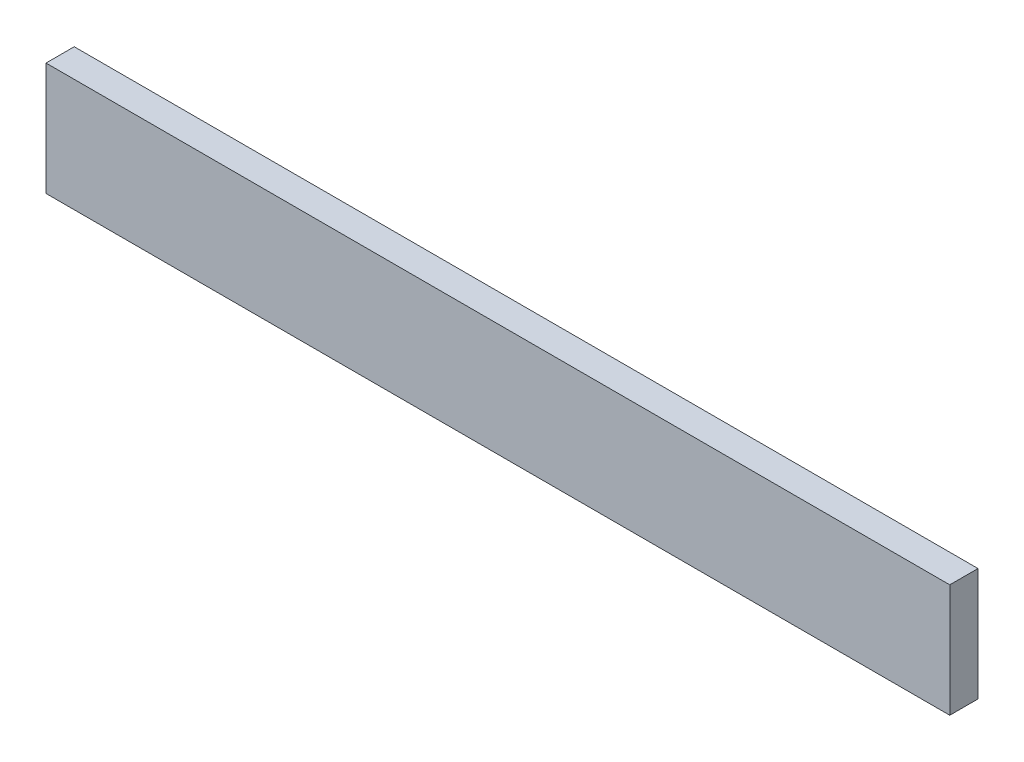
ISO-10303-21;
HEADER;
FILE_DESCRIPTION(('STEP AP214'),'2;1');
FILE_NAME('part.step','',(''),(''),'','','');
FILE_SCHEMA(('AUTOMOTIVE_DESIGN { 1 0 10303 214 1 1 1 1 }'));
ENDSEC;
DATA;
#1=APPLICATION_CONTEXT('core data for automotive mechanical design processes');
#2=APPLICATION_PROTOCOL_DEFINITION('international standard','automotive_design',2000,#1);
#3=PRODUCT_CONTEXT('',#1,'mechanical');
#4=PRODUCT('Part','Part','',(#3));
#5=PRODUCT_RELATED_PRODUCT_CATEGORY('part','',(#4));
#6=PRODUCT_DEFINITION_FORMATION('','',#4);
#7=PRODUCT_DEFINITION_CONTEXT('part definition',#1,'design');
#8=PRODUCT_DEFINITION('design','',#6,#7);
#9=PRODUCT_DEFINITION_SHAPE('','',#8);
#10=(LENGTH_UNIT() NAMED_UNIT(*) SI_UNIT(.MILLI.,.METRE.));
#11=(NAMED_UNIT(*) PLANE_ANGLE_UNIT() SI_UNIT($,.RADIAN.));
#12=(NAMED_UNIT(*) SI_UNIT($,.STERADIAN.) SOLID_ANGLE_UNIT());
#13=UNCERTAINTY_MEASURE_WITH_UNIT(LENGTH_MEASURE(1.E-05),#10,'distance_accuracy_value','');
#14=(GEOMETRIC_REPRESENTATION_CONTEXT(3) GLOBAL_UNCERTAINTY_ASSIGNED_CONTEXT((#13)) GLOBAL_UNIT_ASSIGNED_CONTEXT((#10,
#11,#12)) REPRESENTATION_CONTEXT('',''));
#15=CARTESIAN_POINT('',(0.,0.,0.));
#16=DIRECTION('',(0.,0.,1.));
#17=DIRECTION('',(1.,0.,0.));
#18=AXIS2_PLACEMENT_3D('',#15,#16,#17);
#19=CARTESIAN_POINT('',(0.,0.,25.));
#20=DIRECTION('',(1.,0.,0.));
#21=DIRECTION('',(0.,0.,-1.));
#22=AXIS2_PLACEMENT_3D('',#19,#20,#21);
#23=PLANE('',#22);
#24=DIRECTION('',(0.,-1.,0.));
#25=VECTOR('',#24,1.);
#26=CARTESIAN_POINT('',(0.,0.,0.));
#27=LINE('',#26,#25);
#28=CARTESIAN_POINT('',(0.,100.,0.));
#29=VERTEX_POINT('',#28);
#30=CARTESIAN_POINT('',(0.,0.,0.));
#31=VERTEX_POINT('',#30);
#32=EDGE_CURVE('E111',#29,#31,#27,.T.);
#33=ORIENTED_EDGE('',*,*,#32,.T.);
#34=DIRECTION('',(0.,0.,-1.));
#35=VECTOR('',#34,1.);
#36=CARTESIAN_POINT('',(0.,0.,25.));
#37=LINE('',#36,#35);
#38=CARTESIAN_POINT('',(0.,0.,25.));
#39=VERTEX_POINT('',#38);
#40=EDGE_CURVE('E11',#39,#31,#37,.T.);
#41=ORIENTED_EDGE('',*,*,#40,.F.);
#42=DIRECTION('',(0.,-1.,0.));
#43=VECTOR('',#42,1.);
#44=CARTESIAN_POINT('',(0.,0.,25.));
#45=LINE('',#44,#43);
#46=CARTESIAN_POINT('',(0.,100.,25.));
#47=VERTEX_POINT('',#46);
#48=EDGE_CURVE('E95',#47,#39,#45,.T.);
#49=ORIENTED_EDGE('',*,*,#48,.F.);
#50=DIRECTION('',(0.,0.,-1.));
#51=VECTOR('',#50,1.);
#52=CARTESIAN_POINT('',(0.,100.,25.));
#53=LINE('',#52,#51);
#54=EDGE_CURVE('E107',#47,#29,#53,.T.);
#55=ORIENTED_EDGE('',*,*,#54,.T.);
#56=EDGE_LOOP('',(#33,#41,#49,#55));
#57=FACE_BOUND('',#56,.T.);
#58=ADVANCED_FACE('F43',(#57),#23,.F.);
#59=CARTESIAN_POINT('',(0.,0.,25.));
#60=DIRECTION('',(0.,1.,0.));
#61=DIRECTION('',(0.,0.,1.));
#62=AXIS2_PLACEMENT_3D('',#59,#60,#61);
#63=PLANE('',#62);
#64=DIRECTION('',(1.,0.,0.));
#65=VECTOR('',#64,1.);
#66=CARTESIAN_POINT('',(0.,0.,0.));
#67=LINE('',#66,#65);
#68=CARTESIAN_POINT('',(800.,0.,0.));
#69=VERTEX_POINT('',#68);
#70=EDGE_CURVE('E100',#31,#69,#67,.T.);
#71=ORIENTED_EDGE('',*,*,#70,.T.);
#72=DIRECTION('',(0.,0.,-1.));
#73=VECTOR('',#72,1.);
#74=CARTESIAN_POINT('',(800.,0.,25.));
#75=LINE('',#74,#73);
#76=CARTESIAN_POINT('',(800.,0.,25.));
#77=VERTEX_POINT('',#76);
#78=EDGE_CURVE('E52',#77,#69,#75,.T.);
#79=ORIENTED_EDGE('',*,*,#78,.F.);
#80=DIRECTION('',(1.,0.,0.));
#81=VECTOR('',#80,1.);
#82=CARTESIAN_POINT('',(0.,0.,25.));
#83=LINE('',#82,#81);
#84=EDGE_CURVE('E90',#39,#77,#83,.T.);
#85=ORIENTED_EDGE('',*,*,#84,.F.);
#86=ORIENTED_EDGE('',*,*,#40,.T.);
#87=EDGE_LOOP('',(#71,#79,#85,#86));
#88=FACE_BOUND('',#87,.T.);
#89=ADVANCED_FACE('F99',(#88),#63,.F.);
#90=CARTESIAN_POINT('',(800.,0.,25.));
#91=DIRECTION('',(-1.,0.,0.));
#92=DIRECTION('',(0.,0.,1.));
#93=AXIS2_PLACEMENT_3D('',#90,#91,#92);
#94=PLANE('',#93);
#95=DIRECTION('',(0.,1.,0.));
#96=VECTOR('',#95,1.);
#97=CARTESIAN_POINT('',(800.,0.,0.));
#98=LINE('',#97,#96);
#99=CARTESIAN_POINT('',(800.,100.,0.));
#100=VERTEX_POINT('',#99);
#101=EDGE_CURVE('E77',#69,#100,#98,.T.);
#102=ORIENTED_EDGE('',*,*,#101,.T.);
#103=DIRECTION('',(0.,0.,-1.));
#104=VECTOR('',#103,1.);
#105=CARTESIAN_POINT('',(800.,100.,25.));
#106=LINE('',#105,#104);
#107=CARTESIAN_POINT('',(800.,100.,25.));
#108=VERTEX_POINT('',#107);
#109=EDGE_CURVE('E102',#108,#100,#106,.T.);
#110=ORIENTED_EDGE('',*,*,#109,.F.);
#111=DIRECTION('',(0.,1.,0.));
#112=VECTOR('',#111,1.);
#113=CARTESIAN_POINT('',(800.,0.,25.));
#114=LINE('',#113,#112);
#115=EDGE_CURVE('E93',#77,#108,#114,.T.);
#116=ORIENTED_EDGE('',*,*,#115,.F.);
#117=ORIENTED_EDGE('',*,*,#78,.T.);
#118=EDGE_LOOP('',(#102,#110,#116,#117));
#119=FACE_BOUND('',#118,.T.);
#120=ADVANCED_FACE('F103',(#119),#94,.F.);
#121=CARTESIAN_POINT('',(0.,100.,25.));
#122=DIRECTION('',(0.,-1.,0.));
#123=DIRECTION('',(0.,0.,-1.));
#124=AXIS2_PLACEMENT_3D('',#121,#122,#123);
#125=PLANE('',#124);
#126=DIRECTION('',(-1.,0.,0.));
#127=VECTOR('',#126,1.);
#128=CARTESIAN_POINT('',(0.,100.,0.));
#129=LINE('',#128,#127);
#130=EDGE_CURVE('E83',#100,#29,#129,.T.);
#131=ORIENTED_EDGE('',*,*,#130,.T.);
#132=ORIENTED_EDGE('',*,*,#54,.F.);
#133=DIRECTION('',(-1.,0.,0.));
#134=VECTOR('',#133,1.);
#135=CARTESIAN_POINT('',(0.,100.,25.));
#136=LINE('',#135,#134);
#137=EDGE_CURVE('E60',#108,#47,#136,.T.);
#138=ORIENTED_EDGE('',*,*,#137,.F.);
#139=ORIENTED_EDGE('',*,*,#109,.T.);
#140=EDGE_LOOP('',(#131,#132,#138,#139));
#141=FACE_BOUND('',#140,.T.);
#142=ADVANCED_FACE('F124',(#141),#125,.F.);
#143=CARTESIAN_POINT('',(0.,0.,25.));
#144=DIRECTION('',(0.,0.,-1.));
#145=DIRECTION('',(-1.,0.,0.));
#146=AXIS2_PLACEMENT_3D('',#143,#144,#145);
#147=PLANE('',#146);
#148=ORIENTED_EDGE('',*,*,#48,.T.);
#149=ORIENTED_EDGE('',*,*,#84,.T.);
#150=ORIENTED_EDGE('',*,*,#115,.T.);
#151=ORIENTED_EDGE('',*,*,#137,.T.);
#152=EDGE_LOOP('',(#148,#149,#150,#151));
#153=FACE_BOUND('',#152,.T.);
#154=ADVANCED_FACE('F91',(#153),#147,.F.);
#155=CARTESIAN_POINT('',(0.,0.,0.));
#156=DIRECTION('',(0.,0.,-1.));
#157=DIRECTION('',(-1.,0.,0.));
#158=AXIS2_PLACEMENT_3D('',#155,#156,#157);
#159=PLANE('',#158);
#160=ORIENTED_EDGE('',*,*,#32,.F.);
#161=ORIENTED_EDGE('',*,*,#130,.F.);
#162=ORIENTED_EDGE('',*,*,#101,.F.);
#163=ORIENTED_EDGE('',*,*,#70,.F.);
#164=EDGE_LOOP('',(#160,#161,#162,#163));
#165=FACE_BOUND('',#164,.T.);
#166=ADVANCED_FACE('F127',(#165),#159,.T.);
#167=CLOSED_SHELL('',(#58,#89,#120,#142,#154,#166));
#168=MANIFOLD_SOLID_BREP('B2',#167);
#169=ADVANCED_BREP_SHAPE_REPRESENTATION('',(#18,#168),#14);
#170=SHAPE_DEFINITION_REPRESENTATION(#9,#169);
ENDSEC;
END-ISO-10303-21;
